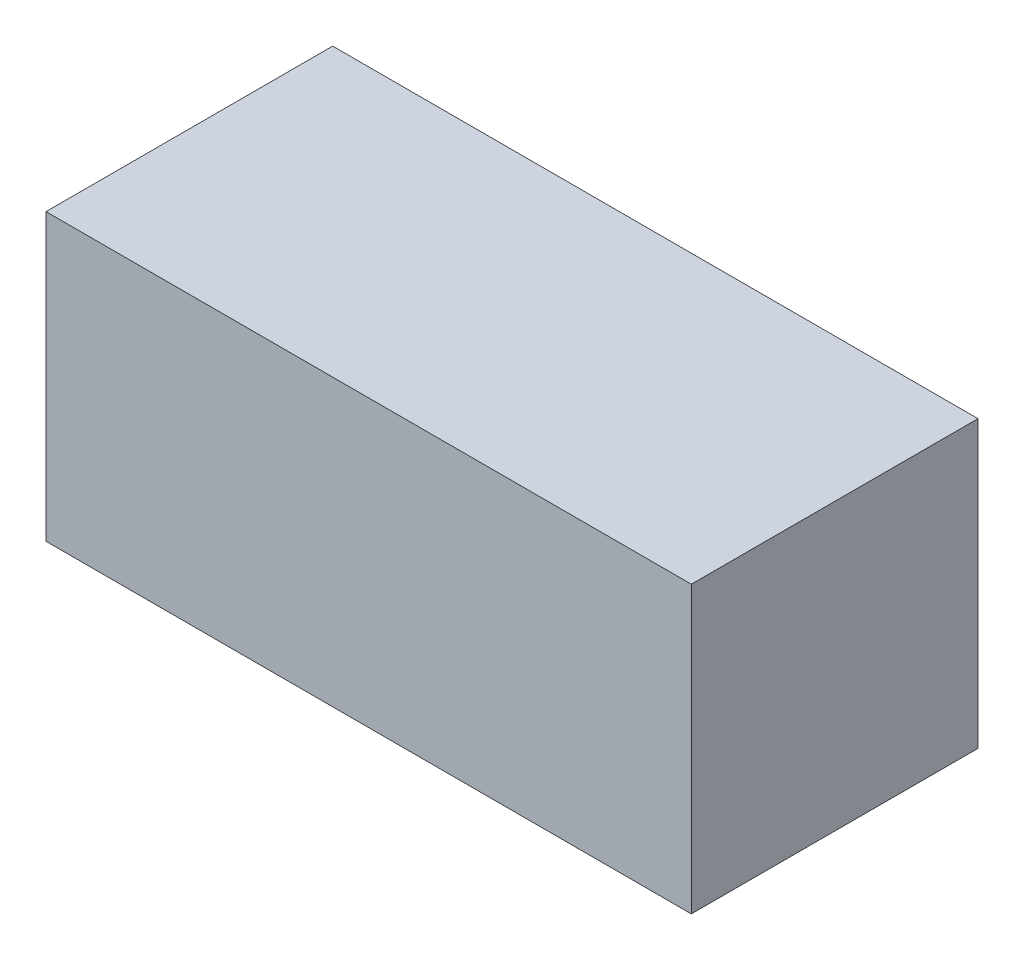
ISO-10303-21;
HEADER;
FILE_DESCRIPTION(('STEP AP214'),'2;1');
FILE_NAME('part.step','',(''),(''),'','','');
FILE_SCHEMA(('AUTOMOTIVE_DESIGN { 1 0 10303 214 1 1 1 1 }'));
ENDSEC;
DATA;
#1=APPLICATION_CONTEXT('core data for automotive mechanical design processes');
#2=APPLICATION_PROTOCOL_DEFINITION('international standard','automotive_design',2000,#1);
#3=PRODUCT_CONTEXT('',#1,'mechanical');
#4=PRODUCT('Part','Part','',(#3));
#5=PRODUCT_RELATED_PRODUCT_CATEGORY('part','',(#4));
#6=PRODUCT_DEFINITION_FORMATION('','',#4);
#7=PRODUCT_DEFINITION_CONTEXT('part definition',#1,'design');
#8=PRODUCT_DEFINITION('design','',#6,#7);
#9=PRODUCT_DEFINITION_SHAPE('','',#8);
#10=(LENGTH_UNIT() NAMED_UNIT(*) SI_UNIT(.MILLI.,.METRE.));
#11=(NAMED_UNIT(*) PLANE_ANGLE_UNIT() SI_UNIT($,.RADIAN.));
#12=(NAMED_UNIT(*) SI_UNIT($,.STERADIAN.) SOLID_ANGLE_UNIT());
#13=UNCERTAINTY_MEASURE_WITH_UNIT(LENGTH_MEASURE(1.E-05),#10,'distance_accuracy_value','');
#14=(GEOMETRIC_REPRESENTATION_CONTEXT(3) GLOBAL_UNCERTAINTY_ASSIGNED_CONTEXT((#13)) GLOBAL_UNIT_ASSIGNED_CONTEXT((#10,
#11,#12)) REPRESENTATION_CONTEXT('',''));
#15=CARTESIAN_POINT('',(0.,0.,0.));
#16=DIRECTION('',(0.,0.,1.));
#17=DIRECTION('',(1.,0.,0.));
#18=AXIS2_PLACEMENT_3D('',#15,#16,#17);
#19=CARTESIAN_POINT('',(1.38745,2.88795,0.));
#20=DIRECTION('',(1.,0.,0.));
#21=DIRECTION('',(0.,0.,1.));
#22=AXIS2_PLACEMENT_3D('',#19,#20,#21);
#23=PLANE('',#22);
#24=DIRECTION('',(0.,1.,0.));
#25=VECTOR('',#24,1.);
#26=CARTESIAN_POINT('',(1.38745,2.88795,0.1));
#27=LINE('',#26,#25);
#28=CARTESIAN_POINT('',(1.38745,2.88795,0.1));
#29=VERTEX_POINT('',#28);
#30=CARTESIAN_POINT('',(1.38745,2.98755,0.1));
#31=VERTEX_POINT('',#30);
#32=EDGE_CURVE('E11',#29,#31,#27,.T.);
#33=ORIENTED_EDGE('',*,*,#32,.T.);
#34=DIRECTION('',(0.,0.,1.));
#35=VECTOR('',#34,1.);
#36=CARTESIAN_POINT('',(1.38745,2.98755,0.));
#37=LINE('',#36,#35);
#38=CARTESIAN_POINT('',(1.38745,2.98755,0.));
#39=VERTEX_POINT('',#38);
#40=EDGE_CURVE('E24',#39,#31,#37,.T.);
#41=ORIENTED_EDGE('',*,*,#40,.F.);
#42=DIRECTION('',(0.,1.,0.));
#43=VECTOR('',#42,1.);
#44=CARTESIAN_POINT('',(1.38745,2.88795,0.));
#45=LINE('',#44,#43);
#46=CARTESIAN_POINT('',(1.38745,2.88795,0.));
#47=VERTEX_POINT('',#46);
#48=EDGE_CURVE('E86',#47,#39,#45,.T.);
#49=ORIENTED_EDGE('',*,*,#48,.F.);
#50=DIRECTION('',(0.,0.,1.));
#51=VECTOR('',#50,1.);
#52=CARTESIAN_POINT('',(1.38745,2.88795,0.));
#53=LINE('',#52,#51);
#54=EDGE_CURVE('E36',#47,#29,#53,.T.);
#55=ORIENTED_EDGE('',*,*,#54,.T.);
#56=EDGE_LOOP('',(#33,#41,#49,#55));
#57=FACE_BOUND('',#56,.T.);
#58=ADVANCED_FACE('F17',(#57),#23,.F.);
#59=CARTESIAN_POINT('',(1.61255,2.88795,0.));
#60=DIRECTION('',(1.,0.,0.));
#61=DIRECTION('',(0.,0.,1.));
#62=AXIS2_PLACEMENT_3D('',#59,#60,#61);
#63=PLANE('',#62);
#64=DIRECTION('',(0.,0.,1.));
#65=VECTOR('',#64,1.);
#66=CARTESIAN_POINT('',(1.61255,2.88795,0.));
#67=LINE('',#66,#65);
#68=CARTESIAN_POINT('',(1.61255,2.88795,0.));
#69=VERTEX_POINT('',#68);
#70=CARTESIAN_POINT('',(1.61255,2.88795,0.1));
#71=VERTEX_POINT('',#70);
#72=EDGE_CURVE('E83',#69,#71,#67,.T.);
#73=ORIENTED_EDGE('',*,*,#72,.F.);
#74=DIRECTION('',(0.,1.,0.));
#75=VECTOR('',#74,1.);
#76=CARTESIAN_POINT('',(1.61255,2.88795,0.));
#77=LINE('',#76,#75);
#78=CARTESIAN_POINT('',(1.61255,2.98755,0.));
#79=VERTEX_POINT('',#78);
#80=EDGE_CURVE('E63',#69,#79,#77,.T.);
#81=ORIENTED_EDGE('',*,*,#80,.T.);
#82=DIRECTION('',(0.,0.,1.));
#83=VECTOR('',#82,1.);
#84=CARTESIAN_POINT('',(1.61255,2.98755,0.));
#85=LINE('',#84,#83);
#86=CARTESIAN_POINT('',(1.61255,2.98755,0.1));
#87=VERTEX_POINT('',#86);
#88=EDGE_CURVE('E57',#79,#87,#85,.T.);
#89=ORIENTED_EDGE('',*,*,#88,.T.);
#90=DIRECTION('',(0.,1.,0.));
#91=VECTOR('',#90,1.);
#92=CARTESIAN_POINT('',(1.61255,2.88795,0.1));
#93=LINE('',#92,#91);
#94=EDGE_CURVE('E60',#71,#87,#93,.T.);
#95=ORIENTED_EDGE('',*,*,#94,.F.);
#96=EDGE_LOOP('',(#73,#81,#89,#95));
#97=FACE_BOUND('',#96,.T.);
#98=ADVANCED_FACE('F59',(#97),#63,.T.);
#99=CARTESIAN_POINT('',(1.38745,2.88795,0.));
#100=DIRECTION('',(0.,1.,0.));
#101=DIRECTION('',(0.,0.,1.));
#102=AXIS2_PLACEMENT_3D('',#99,#100,#101);
#103=PLANE('',#102);
#104=ORIENTED_EDGE('',*,*,#72,.T.);
#105=DIRECTION('',(1.,0.,0.));
#106=VECTOR('',#105,1.);
#107=CARTESIAN_POINT('',(1.38745,2.88795,0.1));
#108=LINE('',#107,#106);
#109=EDGE_CURVE('E71',#29,#71,#108,.T.);
#110=ORIENTED_EDGE('',*,*,#109,.F.);
#111=ORIENTED_EDGE('',*,*,#54,.F.);
#112=DIRECTION('',(1.,0.,0.));
#113=VECTOR('',#112,1.);
#114=CARTESIAN_POINT('',(1.38745,2.88795,0.));
#115=LINE('',#114,#113);
#116=EDGE_CURVE('E76',#47,#69,#115,.T.);
#117=ORIENTED_EDGE('',*,*,#116,.T.);
#118=EDGE_LOOP('',(#104,#110,#111,#117));
#119=FACE_BOUND('',#118,.T.);
#120=ADVANCED_FACE('F91',(#119),#103,.F.);
#121=CARTESIAN_POINT('',(1.38745,2.98755,0.));
#122=DIRECTION('',(0.,1.,0.));
#123=DIRECTION('',(0.,0.,1.));
#124=AXIS2_PLACEMENT_3D('',#121,#122,#123);
#125=PLANE('',#124);
#126=DIRECTION('',(1.,0.,0.));
#127=VECTOR('',#126,1.);
#128=CARTESIAN_POINT('',(1.38745,2.98755,0.));
#129=LINE('',#128,#127);
#130=EDGE_CURVE('E74',#39,#79,#129,.T.);
#131=ORIENTED_EDGE('',*,*,#130,.F.);
#132=ORIENTED_EDGE('',*,*,#40,.T.);
#133=DIRECTION('',(1.,0.,0.));
#134=VECTOR('',#133,1.);
#135=CARTESIAN_POINT('',(1.38745,2.98755,0.1));
#136=LINE('',#135,#134);
#137=EDGE_CURVE('E69',#31,#87,#136,.T.);
#138=ORIENTED_EDGE('',*,*,#137,.T.);
#139=ORIENTED_EDGE('',*,*,#88,.F.);
#140=EDGE_LOOP('',(#131,#132,#138,#139));
#141=FACE_BOUND('',#140,.T.);
#142=ADVANCED_FACE('F73',(#141),#125,.T.);
#143=CARTESIAN_POINT('',(1.38745,2.88795,0.));
#144=DIRECTION('',(0.,0.,1.));
#145=DIRECTION('',(1.,0.,0.));
#146=AXIS2_PLACEMENT_3D('',#143,#144,#145);
#147=PLANE('',#146);
#148=ORIENTED_EDGE('',*,*,#130,.T.);
#149=ORIENTED_EDGE('',*,*,#80,.F.);
#150=ORIENTED_EDGE('',*,*,#116,.F.);
#151=ORIENTED_EDGE('',*,*,#48,.T.);
#152=EDGE_LOOP('',(#148,#149,#150,#151));
#153=FACE_BOUND('',#152,.T.);
#154=ADVANCED_FACE('F89',(#153),#147,.F.);
#155=CARTESIAN_POINT('',(1.38745,2.88795,0.1));
#156=DIRECTION('',(0.,0.,1.));
#157=DIRECTION('',(1.,0.,0.));
#158=AXIS2_PLACEMENT_3D('',#155,#156,#157);
#159=PLANE('',#158);
#160=ORIENTED_EDGE('',*,*,#32,.F.);
#161=ORIENTED_EDGE('',*,*,#109,.T.);
#162=ORIENTED_EDGE('',*,*,#94,.T.);
#163=ORIENTED_EDGE('',*,*,#137,.F.);
#164=EDGE_LOOP('',(#160,#161,#162,#163));
#165=FACE_BOUND('',#164,.T.);
#166=ADVANCED_FACE('F68',(#165),#159,.T.);
#167=CLOSED_SHELL('',(#58,#98,#120,#142,#154,#166));
#168=MANIFOLD_SOLID_BREP('B1',#167);
#169=ADVANCED_BREP_SHAPE_REPRESENTATION('',(#18,#168),#14);
#170=SHAPE_DEFINITION_REPRESENTATION(#9,#169);
ENDSEC;
END-ISO-10303-21;
